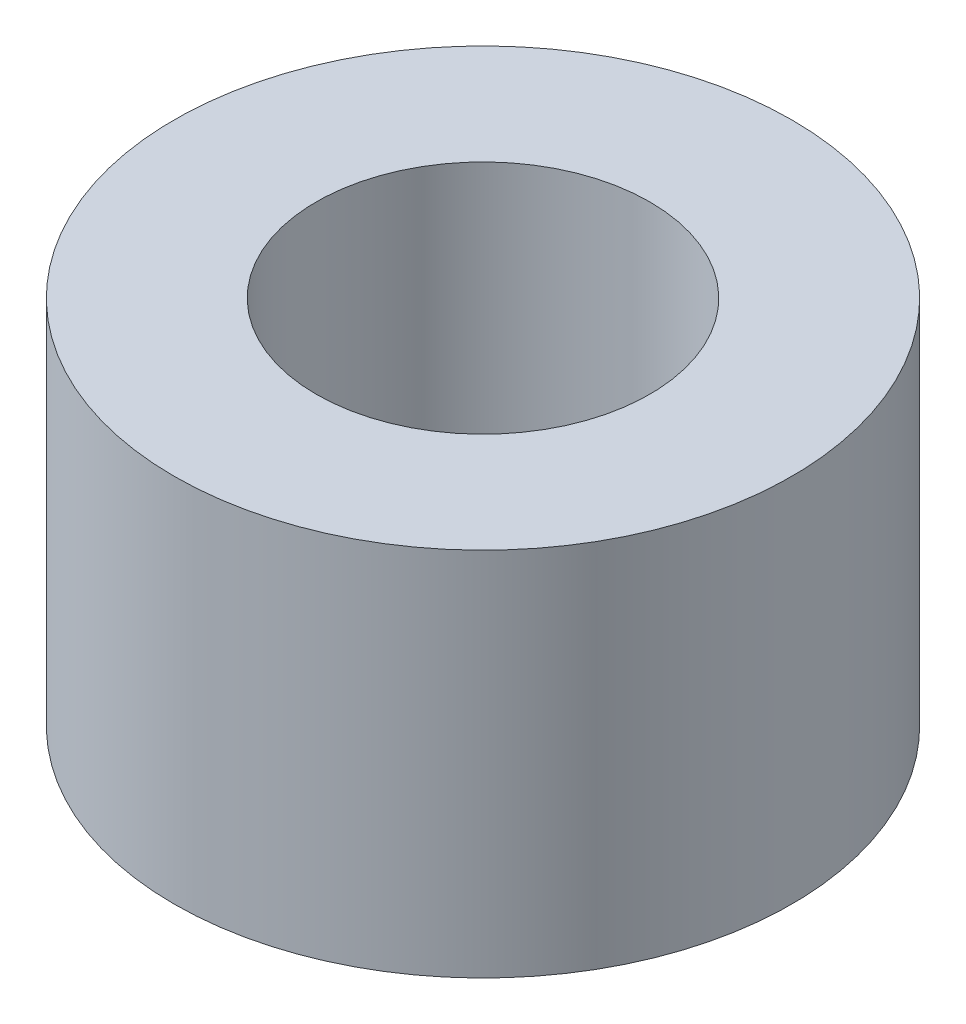
ISO-10303-21;
HEADER;
FILE_DESCRIPTION(('STEP AP214'),'2;1');
FILE_NAME('part.step','',(''),(''),'','','');
FILE_SCHEMA(('AUTOMOTIVE_DESIGN { 1 0 10303 214 1 1 1 1 }'));
ENDSEC;
DATA;
#1=APPLICATION_CONTEXT('core data for automotive mechanical design processes');
#2=APPLICATION_PROTOCOL_DEFINITION('international standard','automotive_design',2000,#1);
#3=PRODUCT_CONTEXT('',#1,'mechanical');
#4=PRODUCT('Part','Part','',(#3));
#5=PRODUCT_RELATED_PRODUCT_CATEGORY('part','',(#4));
#6=PRODUCT_DEFINITION_FORMATION('','',#4);
#7=PRODUCT_DEFINITION_CONTEXT('part definition',#1,'design');
#8=PRODUCT_DEFINITION('design','',#6,#7);
#9=PRODUCT_DEFINITION_SHAPE('','',#8);
#10=(LENGTH_UNIT() NAMED_UNIT(*) SI_UNIT(.MILLI.,.METRE.));
#11=(NAMED_UNIT(*) PLANE_ANGLE_UNIT() SI_UNIT($,.RADIAN.));
#12=(NAMED_UNIT(*) SI_UNIT($,.STERADIAN.) SOLID_ANGLE_UNIT());
#13=UNCERTAINTY_MEASURE_WITH_UNIT(LENGTH_MEASURE(1.E-05),#10,'distance_accuracy_value','');
#14=(GEOMETRIC_REPRESENTATION_CONTEXT(3) GLOBAL_UNCERTAINTY_ASSIGNED_CONTEXT((#13)) GLOBAL_UNIT_ASSIGNED_CONTEXT((#10,
#11,#12)) REPRESENTATION_CONTEXT('',''));
#15=CARTESIAN_POINT('',(0.,0.,0.));
#16=DIRECTION('',(0.,0.,1.));
#17=DIRECTION('',(1.,0.,0.));
#18=AXIS2_PLACEMENT_3D('',#15,#16,#17);
#19=CARTESIAN_POINT('',(0.,6.,0.));
#20=DIRECTION('',(0.,1.,0.));
#21=DIRECTION('',(0.,0.,1.));
#22=AXIS2_PLACEMENT_3D('',#19,#20,#21);
#23=PLANE('',#22);
#24=CARTESIAN_POINT('',(0.,6.,0.));
#25=DIRECTION('',(0.,1.,0.));
#26=DIRECTION('',(0.,0.,1.));
#27=AXIS2_PLACEMENT_3D('',#24,#25,#26);
#28=CIRCLE('',#27,5.);
#29=CARTESIAN_POINT('',(0.,6.,5.));
#30=VERTEX_POINT('',#29);
#31=EDGE_CURVE('E10',#30,#30,#28,.T.);
#32=ORIENTED_EDGE('',*,*,#31,.T.);
#33=EDGE_LOOP('',(#32));
#34=FACE_BOUND('',#33,.T.);
#35=CARTESIAN_POINT('',(0.,6.,0.));
#36=DIRECTION('',(0.,1.,0.));
#37=DIRECTION('',(0.,0.,1.));
#38=AXIS2_PLACEMENT_3D('',#35,#36,#37);
#39=CIRCLE('',#38,2.7);
#40=CARTESIAN_POINT('',(0.,6.,2.7));
#41=VERTEX_POINT('',#40);
#42=EDGE_CURVE('E42',#41,#41,#39,.T.);
#43=ORIENTED_EDGE('',*,*,#42,.F.);
#44=EDGE_LOOP('',(#43));
#45=FACE_BOUND('',#44,.T.);
#46=ADVANCED_FACE('F31',(#34,#45),#23,.T.);
#47=CARTESIAN_POINT('',(0.,0.,0.));
#48=DIRECTION('',(0.,1.,0.));
#49=DIRECTION('',(0.,0.,1.));
#50=AXIS2_PLACEMENT_3D('',#47,#48,#49);
#51=PLANE('',#50);
#52=CARTESIAN_POINT('',(0.,0.,0.));
#53=DIRECTION('',(0.,1.,0.));
#54=DIRECTION('',(0.,0.,1.));
#55=AXIS2_PLACEMENT_3D('',#52,#53,#54);
#56=CIRCLE('',#55,5.);
#57=CARTESIAN_POINT('',(0.,0.,5.));
#58=VERTEX_POINT('',#57);
#59=EDGE_CURVE('E35',#58,#58,#56,.T.);
#60=ORIENTED_EDGE('',*,*,#59,.F.);
#61=EDGE_LOOP('',(#60));
#62=FACE_BOUND('',#61,.T.);
#63=CARTESIAN_POINT('',(0.,0.,0.));
#64=DIRECTION('',(0.,1.,0.));
#65=DIRECTION('',(0.,0.,1.));
#66=AXIS2_PLACEMENT_3D('',#63,#64,#65);
#67=CIRCLE('',#66,2.7);
#68=CARTESIAN_POINT('',(0.,0.,2.7));
#69=VERTEX_POINT('',#68);
#70=EDGE_CURVE('E44',#69,#69,#67,.T.);
#71=ORIENTED_EDGE('',*,*,#70,.T.);
#72=EDGE_LOOP('',(#71));
#73=FACE_BOUND('',#72,.T.);
#74=ADVANCED_FACE('F54',(#62,#73),#51,.F.);
#75=CARTESIAN_POINT('',(0.,6.,0.));
#76=DIRECTION('',(0.,-1.,0.));
#77=DIRECTION('',(0.,0.,-1.));
#78=AXIS2_PLACEMENT_3D('',#75,#76,#77);
#79=CYLINDRICAL_SURFACE('',#78,5.);
#80=ORIENTED_EDGE('',*,*,#31,.F.);
#81=EDGE_LOOP('',(#80));
#82=FACE_BOUND('',#81,.T.);
#83=ORIENTED_EDGE('',*,*,#59,.T.);
#84=EDGE_LOOP('',(#83));
#85=FACE_BOUND('',#84,.T.);
#86=ADVANCED_FACE('F33',(#82,#85),#79,.T.);
#87=CARTESIAN_POINT('',(0.,6.,0.));
#88=DIRECTION('',(0.,-1.,0.));
#89=DIRECTION('',(0.,0.,-1.));
#90=AXIS2_PLACEMENT_3D('',#87,#88,#89);
#91=CYLINDRICAL_SURFACE('',#90,2.7);
#92=ORIENTED_EDGE('',*,*,#42,.T.);
#93=EDGE_LOOP('',(#92));
#94=FACE_BOUND('',#93,.T.);
#95=ORIENTED_EDGE('',*,*,#70,.F.);
#96=EDGE_LOOP('',(#95));
#97=FACE_BOUND('',#96,.T.);
#98=ADVANCED_FACE('F50',(#94,#97),#91,.F.);
#99=CLOSED_SHELL('',(#46,#74,#86,#98));
#100=MANIFOLD_SOLID_BREP('B2',#99);
#101=ADVANCED_BREP_SHAPE_REPRESENTATION('',(#18,#100),#14);
#102=SHAPE_DEFINITION_REPRESENTATION(#9,#101);
ENDSEC;
END-ISO-10303-21;
